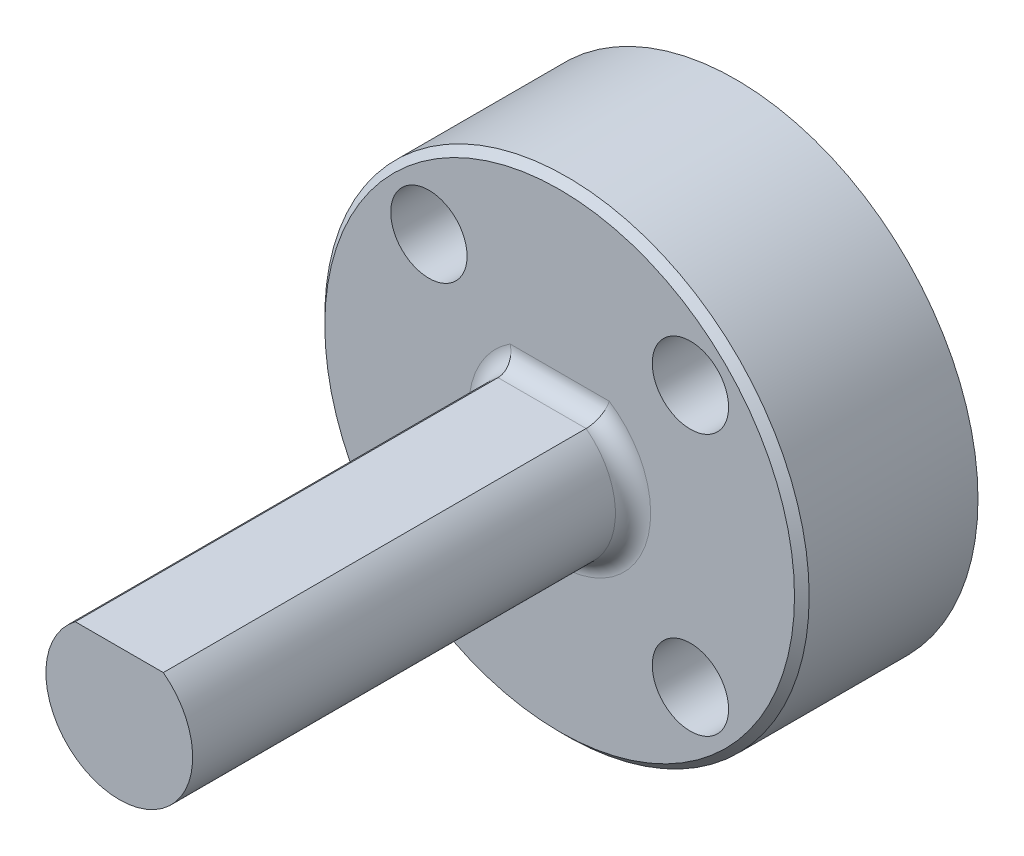
ISO-10303-21;
HEADER;
FILE_DESCRIPTION(('STEP AP214'),'2;1');
FILE_NAME('part.step','',(''),(''),'','','');
FILE_SCHEMA(('AUTOMOTIVE_DESIGN { 1 0 10303 214 1 1 1 1 }'));
ENDSEC;
DATA;
#1=APPLICATION_CONTEXT('core data for automotive mechanical design processes');
#2=APPLICATION_PROTOCOL_DEFINITION('international standard','automotive_design',2000,#1);
#3=PRODUCT_CONTEXT('',#1,'mechanical');
#4=PRODUCT('Part','Part','',(#3));
#5=PRODUCT_RELATED_PRODUCT_CATEGORY('part','',(#4));
#6=PRODUCT_DEFINITION_FORMATION('','',#4);
#7=PRODUCT_DEFINITION_CONTEXT('part definition',#1,'design');
#8=PRODUCT_DEFINITION('design','',#6,#7);
#9=PRODUCT_DEFINITION_SHAPE('','',#8);
#10=(LENGTH_UNIT() NAMED_UNIT(*) SI_UNIT(.MILLI.,.METRE.));
#11=(NAMED_UNIT(*) PLANE_ANGLE_UNIT() SI_UNIT($,.RADIAN.));
#12=(NAMED_UNIT(*) SI_UNIT($,.STERADIAN.) SOLID_ANGLE_UNIT());
#13=UNCERTAINTY_MEASURE_WITH_UNIT(LENGTH_MEASURE(1.E-05),#10,'distance_accuracy_value','');
#14=(GEOMETRIC_REPRESENTATION_CONTEXT(3) GLOBAL_UNCERTAINTY_ASSIGNED_CONTEXT((#13)) GLOBAL_UNIT_ASSIGNED_CONTEXT((#10,
#11,#12)) REPRESENTATION_CONTEXT('',''));
#15=CARTESIAN_POINT('',(0.,0.,0.));
#16=DIRECTION('',(0.,0.,1.));
#17=DIRECTION('',(1.,0.,0.));
#18=AXIS2_PLACEMENT_3D('',#15,#16,#17);
#19=CARTESIAN_POINT('',(5.65685424949245,17.6568542494923,26.67));
#20=DIRECTION('',(0.,0.,-1.));
#21=DIRECTION('',(-1.,0.,0.));
#22=AXIS2_PLACEMENT_3D('',#19,#20,#21);
#23=CYLINDRICAL_SURFACE('',#22,1.27);
#24=CARTESIAN_POINT('',(5.65685424949245,17.6568542494923,0.));
#25=DIRECTION('',(0.,0.,1.));
#26=DIRECTION('',(1.,0.,0.));
#27=AXIS2_PLACEMENT_3D('',#24,#25,#26);
#28=CIRCLE('',#27,1.27);
#29=CARTESIAN_POINT('',(6.92685424949245,17.6568542494923,0.));
#30=VERTEX_POINT('',#29);
#31=EDGE_CURVE('E133',#30,#30,#28,.T.);
#32=ORIENTED_EDGE('',*,*,#31,.F.);
#33=EDGE_LOOP('',(#32));
#34=FACE_BOUND('',#33,.T.);
#35=CARTESIAN_POINT('',(5.65685424949245,17.6568542494923,3.302));
#36=DIRECTION('',(0.,0.,1.));
#37=DIRECTION('',(1.,0.,0.));
#38=AXIS2_PLACEMENT_3D('',#35,#36,#37);
#39=CIRCLE('',#38,1.27);
#40=CARTESIAN_POINT('',(6.92685424949245,17.6568542494923,3.302));
#41=VERTEX_POINT('',#40);
#42=EDGE_CURVE('E138',#41,#41,#39,.F.);
#43=ORIENTED_EDGE('',*,*,#42,.F.);
#44=EDGE_LOOP('',(#43));
#45=FACE_BOUND('',#44,.T.);
#46=ADVANCED_FACE('F45',(#34,#45),#23,.F.);
#47=CARTESIAN_POINT('',(-5.65685424949229,17.6568542494923,26.67));
#48=DIRECTION('',(0.,0.,-1.));
#49=DIRECTION('',(-1.,0.,0.));
#50=AXIS2_PLACEMENT_3D('',#47,#48,#49);
#51=CYLINDRICAL_SURFACE('',#50,1.27);
#52=CARTESIAN_POINT('',(-5.65685424949229,17.6568542494923,0.));
#53=DIRECTION('',(0.,0.,1.));
#54=DIRECTION('',(1.,0.,0.));
#55=AXIS2_PLACEMENT_3D('',#52,#53,#54);
#56=CIRCLE('',#55,1.27);
#57=CARTESIAN_POINT('',(-4.38685424949229,17.6568542494923,0.));
#58=VERTEX_POINT('',#57);
#59=EDGE_CURVE('E137',#58,#58,#56,.T.);
#60=ORIENTED_EDGE('',*,*,#59,.F.);
#61=EDGE_LOOP('',(#60));
#62=FACE_BOUND('',#61,.T.);
#63=CARTESIAN_POINT('',(-5.65685424949229,17.6568542494923,3.302));
#64=DIRECTION('',(0.,0.,1.));
#65=DIRECTION('',(1.,0.,0.));
#66=AXIS2_PLACEMENT_3D('',#63,#64,#65);
#67=CIRCLE('',#66,1.27);
#68=CARTESIAN_POINT('',(-4.38685424949229,17.6568542494923,3.302));
#69=VERTEX_POINT('',#68);
#70=EDGE_CURVE('E158',#69,#69,#67,.F.);
#71=ORIENTED_EDGE('',*,*,#70,.F.);
#72=EDGE_LOOP('',(#71));
#73=FACE_BOUND('',#72,.T.);
#74=ADVANCED_FACE('F235',(#62,#73),#51,.F.);
#75=CARTESIAN_POINT('',(-5.65685424949247,6.34314575050743,26.67));
#76=DIRECTION('',(0.,0.,-1.));
#77=DIRECTION('',(-1.,0.,0.));
#78=AXIS2_PLACEMENT_3D('',#75,#76,#77);
#79=CYLINDRICAL_SURFACE('',#78,1.27);
#80=CARTESIAN_POINT('',(-5.65685424949247,6.34314575050743,0.));
#81=DIRECTION('',(0.,0.,1.));
#82=DIRECTION('',(1.,0.,0.));
#83=AXIS2_PLACEMENT_3D('',#80,#81,#82);
#84=CIRCLE('',#83,1.27);
#85=CARTESIAN_POINT('',(-4.38685424949247,6.34314575050743,0.));
#86=VERTEX_POINT('',#85);
#87=EDGE_CURVE('E142',#86,#86,#84,.T.);
#88=ORIENTED_EDGE('',*,*,#87,.F.);
#89=EDGE_LOOP('',(#88));
#90=FACE_BOUND('',#89,.T.);
#91=CARTESIAN_POINT('',(-5.65685424949247,6.34314575050743,3.302));
#92=DIRECTION('',(0.,0.,1.));
#93=DIRECTION('',(1.,0.,0.));
#94=AXIS2_PLACEMENT_3D('',#91,#92,#93);
#95=CIRCLE('',#94,1.27);
#96=CARTESIAN_POINT('',(-4.38685424949247,6.34314575050743,3.302));
#97=VERTEX_POINT('',#96);
#98=EDGE_CURVE('E153',#97,#97,#95,.F.);
#99=ORIENTED_EDGE('',*,*,#98,.F.);
#100=EDGE_LOOP('',(#99));
#101=FACE_BOUND('',#100,.T.);
#102=ADVANCED_FACE('F239',(#90,#101),#79,.F.);
#103=CARTESIAN_POINT('',(5.65685424949246,6.34314575050743,26.67));
#104=DIRECTION('',(0.,0.,-1.));
#105=DIRECTION('',(-1.,0.,0.));
#106=AXIS2_PLACEMENT_3D('',#103,#104,#105);
#107=CYLINDRICAL_SURFACE('',#106,1.27);
#108=CARTESIAN_POINT('',(5.65685424949246,6.34314575050743,0.));
#109=DIRECTION('',(0.,0.,1.));
#110=DIRECTION('',(1.,0.,0.));
#111=AXIS2_PLACEMENT_3D('',#108,#109,#110);
#112=CIRCLE('',#111,1.27);
#113=CARTESIAN_POINT('',(6.92685424949246,6.34314575050743,0.));
#114=VERTEX_POINT('',#113);
#115=EDGE_CURVE('E103',#114,#114,#112,.T.);
#116=ORIENTED_EDGE('',*,*,#115,.F.);
#117=EDGE_LOOP('',(#116));
#118=FACE_BOUND('',#117,.T.);
#119=CARTESIAN_POINT('',(5.65685424949246,6.34314575050743,3.302));
#120=DIRECTION('',(0.,0.,1.));
#121=DIRECTION('',(1.,0.,0.));
#122=AXIS2_PLACEMENT_3D('',#119,#120,#121);
#123=CIRCLE('',#122,1.27);
#124=CARTESIAN_POINT('',(6.92685424949246,6.34314575050743,3.302));
#125=VERTEX_POINT('',#124);
#126=EDGE_CURVE('E149',#125,#125,#123,.F.);
#127=ORIENTED_EDGE('',*,*,#126,.F.);
#128=EDGE_LOOP('',(#127));
#129=FACE_BOUND('',#128,.T.);
#130=ADVANCED_FACE('F202',(#118,#129),#107,.F.);
#131=CARTESIAN_POINT('',(0.,12.,7.62));
#132=DIRECTION('',(0.,0.,-1.));
#133=DIRECTION('',(-1.,0.,0.));
#134=AXIS2_PLACEMENT_3D('',#131,#132,#133);
#135=CYLINDRICAL_SURFACE('',#134,10.4775);
#136=CARTESIAN_POINT('',(0.,12.,7.30250000000002));
#137=DIRECTION('',(0.,0.,1.));
#138=DIRECTION('',(1.,0.,0.));
#139=AXIS2_PLACEMENT_3D('',#136,#137,#138);
#140=CIRCLE('',#139,10.4775);
#141=CARTESIAN_POINT('',(10.4775,12.,7.30250000000002));
#142=VERTEX_POINT('',#141);
#143=EDGE_CURVE('E168',#142,#142,#140,.F.);
#144=ORIENTED_EDGE('',*,*,#143,.T.);
#145=EDGE_LOOP('',(#144));
#146=FACE_BOUND('',#145,.T.);
#147=CARTESIAN_POINT('',(0.,12.,0.));
#148=DIRECTION('',(0.,0.,1.));
#149=DIRECTION('',(1.,0.,0.));
#150=AXIS2_PLACEMENT_3D('',#147,#148,#149);
#151=CIRCLE('',#150,10.4775);
#152=CARTESIAN_POINT('',(10.4775,12.,0.));
#153=VERTEX_POINT('',#152);
#154=EDGE_CURVE('E125',#153,#153,#151,.T.);
#155=ORIENTED_EDGE('',*,*,#154,.T.);
#156=EDGE_LOOP('',(#155));
#157=FACE_BOUND('',#156,.T.);
#158=ADVANCED_FACE('F198',(#146,#157),#135,.T.);
#159=CARTESIAN_POINT('',(0.,12.,7.62));
#160=DIRECTION('',(0.,0.,1.));
#161=DIRECTION('',(1.,0.,0.));
#162=AXIS2_PLACEMENT_3D('',#159,#160,#161);
#163=PLANE('',#162);
#164=CARTESIAN_POINT('',(0.,12.,7.62));
#165=DIRECTION('',(0.,0.,1.));
#166=DIRECTION('',(1.,0.,0.));
#167=AXIS2_PLACEMENT_3D('',#164,#165,#166);
#168=CIRCLE('',#167,3.937);
#169=CARTESIAN_POINT('',(2.14400676304903,15.302,7.62));
#170=VERTEX_POINT('',#169);
#171=CARTESIAN_POINT('',(-2.14400676304903,15.302,7.62));
#172=VERTEX_POINT('',#171);
#173=EDGE_CURVE('E67',#170,#172,#168,.F.);
#174=ORIENTED_EDGE('',*,*,#173,.T.);
#175=DIRECTION('',(-1.,0.,0.));
#176=VECTOR('',#175,1.);
#177=CARTESIAN_POINT('',(0.,15.302,7.62));
#178=LINE('',#177,#176);
#179=EDGE_CURVE('E60',#172,#170,#178,.F.);
#180=ORIENTED_EDGE('',*,*,#179,.T.);
#181=EDGE_LOOP('',(#174,#180));
#182=FACE_BOUND('',#181,.T.);
#183=CARTESIAN_POINT('',(0.,12.,7.62));
#184=DIRECTION('',(0.,0.,1.));
#185=DIRECTION('',(1.,0.,0.));
#186=AXIS2_PLACEMENT_3D('',#183,#184,#185);
#187=CIRCLE('',#186,10.16);
#188=CARTESIAN_POINT('',(10.16,12.,7.62));
#189=VERTEX_POINT('',#188);
#190=EDGE_CURVE('E132',#189,#189,#187,.T.);
#191=ORIENTED_EDGE('',*,*,#190,.T.);
#192=EDGE_LOOP('',(#191));
#193=FACE_BOUND('',#192,.T.);
#194=CARTESIAN_POINT('',(-5.65685424949247,6.34314575050743,7.62));
#195=DIRECTION('',(0.,0.,1.));
#196=DIRECTION('',(1.,0.,0.));
#197=AXIS2_PLACEMENT_3D('',#194,#195,#196);
#198=CIRCLE('',#197,1.651);
#199=CARTESIAN_POINT('',(-4.00585424949247,6.34314575050743,7.62));
#200=VERTEX_POINT('',#199);
#201=EDGE_CURVE('E303',#200,#200,#198,.T.);
#202=ORIENTED_EDGE('',*,*,#201,.F.);
#203=EDGE_LOOP('',(#202));
#204=FACE_BOUND('',#203,.T.);
#205=CARTESIAN_POINT('',(5.65685424949246,6.34314575050743,7.62));
#206=DIRECTION('',(0.,0.,1.));
#207=DIRECTION('',(1.,0.,0.));
#208=AXIS2_PLACEMENT_3D('',#205,#206,#207);
#209=CIRCLE('',#208,1.651);
#210=CARTESIAN_POINT('',(7.30785424949246,6.34314575050743,7.62));
#211=VERTEX_POINT('',#210);
#212=EDGE_CURVE('E293',#211,#211,#209,.T.);
#213=ORIENTED_EDGE('',*,*,#212,.F.);
#214=EDGE_LOOP('',(#213));
#215=FACE_BOUND('',#214,.T.);
#216=CARTESIAN_POINT('',(5.65685424949245,17.6568542494923,7.62));
#217=DIRECTION('',(0.,0.,1.));
#218=DIRECTION('',(1.,0.,0.));
#219=AXIS2_PLACEMENT_3D('',#216,#217,#218);
#220=CIRCLE('',#219,1.651);
#221=CARTESIAN_POINT('',(7.30785424949245,17.6568542494923,7.62));
#222=VERTEX_POINT('',#221);
#223=EDGE_CURVE('E284',#222,#222,#220,.T.);
#224=ORIENTED_EDGE('',*,*,#223,.F.);
#225=EDGE_LOOP('',(#224));
#226=FACE_BOUND('',#225,.T.);
#227=CARTESIAN_POINT('',(-5.65685424949229,17.6568542494923,7.62));
#228=DIRECTION('',(0.,0.,1.));
#229=DIRECTION('',(1.,0.,0.));
#230=AXIS2_PLACEMENT_3D('',#227,#228,#229);
#231=CIRCLE('',#230,1.651);
#232=CARTESIAN_POINT('',(-4.00585424949229,17.6568542494923,7.62));
#233=VERTEX_POINT('',#232);
#234=EDGE_CURVE('E287',#233,#233,#231,.T.);
#235=ORIENTED_EDGE('',*,*,#234,.F.);
#236=EDGE_LOOP('',(#235));
#237=FACE_BOUND('',#236,.T.);
#238=ADVANCED_FACE('F201',(#182,#193,#204,#215,#226,#237),#163,.T.);
#239=CARTESIAN_POINT('',(0.,12.,0.));
#240=DIRECTION('',(0.,0.,1.));
#241=DIRECTION('',(1.,0.,0.));
#242=AXIS2_PLACEMENT_3D('',#239,#240,#241);
#243=PLANE('',#242);
#244=ORIENTED_EDGE('',*,*,#115,.T.);
#245=EDGE_LOOP('',(#244));
#246=FACE_BOUND('',#245,.T.);
#247=ORIENTED_EDGE('',*,*,#87,.T.);
#248=EDGE_LOOP('',(#247));
#249=FACE_BOUND('',#248,.T.);
#250=ORIENTED_EDGE('',*,*,#59,.T.);
#251=EDGE_LOOP('',(#250));
#252=FACE_BOUND('',#251,.T.);
#253=ORIENTED_EDGE('',*,*,#31,.T.);
#254=EDGE_LOOP('',(#253));
#255=FACE_BOUND('',#254,.T.);
#256=CARTESIAN_POINT('',(0.,12.,0.));
#257=DIRECTION('',(0.,0.,-1.));
#258=DIRECTION('',(-1.,0.,0.));
#259=AXIS2_PLACEMENT_3D('',#256,#257,#258);
#260=CIRCLE('',#259,4.1275);
#261=CARTESIAN_POINT('',(-4.1275,12.,0.));
#262=VERTEX_POINT('',#261);
#263=EDGE_CURVE('E119',#262,#262,#260,.T.);
#264=ORIENTED_EDGE('',*,*,#263,.F.);
#265=EDGE_LOOP('',(#264));
#266=FACE_BOUND('',#265,.T.);
#267=ORIENTED_EDGE('',*,*,#154,.F.);
#268=EDGE_LOOP('',(#267));
#269=FACE_BOUND('',#268,.T.);
#270=ADVANCED_FACE('F204',(#246,#249,#252,#255,#266,#269),#243,.F.);
#271=CARTESIAN_POINT('',(0.,12.,2.286));
#272=DIRECTION('',(0.,0.,-1.));
#273=DIRECTION('',(-1.,0.,0.));
#274=AXIS2_PLACEMENT_3D('',#271,#272,#273);
#275=CYLINDRICAL_SURFACE('',#274,4.1275);
#276=CARTESIAN_POINT('',(0.,12.,2.286));
#277=DIRECTION('',(0.,0.,-1.));
#278=DIRECTION('',(-1.,0.,0.));
#279=AXIS2_PLACEMENT_3D('',#276,#277,#278);
#280=CIRCLE('',#279,4.1275);
#281=CARTESIAN_POINT('',(-4.1275,12.,2.286));
#282=VERTEX_POINT('',#281);
#283=EDGE_CURVE('E121',#282,#282,#280,.T.);
#284=ORIENTED_EDGE('',*,*,#283,.F.);
#285=EDGE_LOOP('',(#284));
#286=FACE_BOUND('',#285,.T.);
#287=ORIENTED_EDGE('',*,*,#263,.T.);
#288=EDGE_LOOP('',(#287));
#289=FACE_BOUND('',#288,.T.);
#290=ADVANCED_FACE('F207',(#286,#289),#275,.F.);
#291=CARTESIAN_POINT('',(0.,12.,2.286));
#292=DIRECTION('',(0.,0.,-1.));
#293=DIRECTION('',(-1.,0.,0.));
#294=AXIS2_PLACEMENT_3D('',#291,#292,#293);
#295=PLANE('',#294);
#296=CARTESIAN_POINT('',(0.,12.,2.286));
#297=DIRECTION('',(0.,0.,-1.));
#298=DIRECTION('',(-1.,0.,0.));
#299=AXIS2_PLACEMENT_3D('',#296,#297,#298);
#300=CIRCLE('',#299,2.413);
#301=CARTESIAN_POINT('',(-2.413,12.,2.286));
#302=VERTEX_POINT('',#301);
#303=EDGE_CURVE('E108',#302,#302,#300,.T.);
#304=ORIENTED_EDGE('',*,*,#303,.F.);
#305=EDGE_LOOP('',(#304));
#306=FACE_BOUND('',#305,.T.);
#307=ORIENTED_EDGE('',*,*,#283,.T.);
#308=EDGE_LOOP('',(#307));
#309=FACE_BOUND('',#308,.T.);
#310=ADVANCED_FACE('F213',(#306,#309),#295,.T.);
#311=CARTESIAN_POINT('',(0.,12.,4.572));
#312=DIRECTION('',(0.,0.,-1.));
#313=DIRECTION('',(-1.,0.,0.));
#314=AXIS2_PLACEMENT_3D('',#311,#312,#313);
#315=CYLINDRICAL_SURFACE('',#314,2.413);
#316=CARTESIAN_POINT('',(0.,12.,4.572));
#317=DIRECTION('',(0.,0.,-1.));
#318=DIRECTION('',(-1.,0.,0.));
#319=AXIS2_PLACEMENT_3D('',#316,#317,#318);
#320=CIRCLE('',#319,2.413);
#321=CARTESIAN_POINT('',(-2.413,12.,4.572));
#322=VERTEX_POINT('',#321);
#323=EDGE_CURVE('E113',#322,#322,#320,.T.);
#324=ORIENTED_EDGE('',*,*,#323,.F.);
#325=EDGE_LOOP('',(#324));
#326=FACE_BOUND('',#325,.T.);
#327=ORIENTED_EDGE('',*,*,#303,.T.);
#328=EDGE_LOOP('',(#327));
#329=FACE_BOUND('',#328,.T.);
#330=ADVANCED_FACE('F217',(#326,#329),#315,.F.);
#331=CARTESIAN_POINT('',(0.,12.,4.572));
#332=DIRECTION('',(0.,0.,-1.));
#333=DIRECTION('',(-1.,0.,0.));
#334=AXIS2_PLACEMENT_3D('',#331,#332,#333);
#335=PLANE('',#334);
#336=ORIENTED_EDGE('',*,*,#323,.T.);
#337=EDGE_LOOP('',(#336));
#338=FACE_BOUND('',#337,.T.);
#339=ADVANCED_FACE('F221',(#338),#335,.T.);
#340=CARTESIAN_POINT('',(0.,12.,26.67));
#341=DIRECTION('',(0.,0.,-1.));
#342=DIRECTION('',(-1.,0.,0.));
#343=AXIS2_PLACEMENT_3D('',#340,#341,#342);
#344=CYLINDRICAL_SURFACE('',#343,3.175);
#345=DIRECTION('',(0.,0.,-1.));
#346=VECTOR('',#345,1.);
#347=CARTESIAN_POINT('',(-1.905,14.54,26.67));
#348=LINE('',#347,#346);
#349=CARTESIAN_POINT('',(-1.905,14.54,26.67));
#350=VERTEX_POINT('',#349);
#351=CARTESIAN_POINT('',(-1.905,14.54,8.38200000000001));
#352=VERTEX_POINT('',#351);
#353=EDGE_CURVE('E94',#350,#352,#348,.T.);
#354=ORIENTED_EDGE('',*,*,#353,.T.);
#355=CARTESIAN_POINT('',(0.,12.,8.382));
#356=DIRECTION('',(0.,0.,1.));
#357=DIRECTION('',(1.,0.,0.));
#358=AXIS2_PLACEMENT_3D('',#355,#356,#357);
#359=CIRCLE('',#358,3.175);
#360=CARTESIAN_POINT('',(1.905,14.54,8.38200000000001));
#361=VERTEX_POINT('',#360);
#362=EDGE_CURVE('E11',#352,#361,#359,.T.);
#363=ORIENTED_EDGE('',*,*,#362,.T.);
#364=DIRECTION('',(0.,0.,-1.));
#365=VECTOR('',#364,1.);
#366=CARTESIAN_POINT('',(1.905,14.54,26.67));
#367=LINE('',#366,#365);
#368=CARTESIAN_POINT('',(1.905,14.54,26.67));
#369=VERTEX_POINT('',#368);
#370=EDGE_CURVE('E92',#369,#361,#367,.T.);
#371=ORIENTED_EDGE('',*,*,#370,.F.);
#372=CARTESIAN_POINT('',(0.,12.,26.67));
#373=DIRECTION('',(0.,0.,1.));
#374=DIRECTION('',(1.,0.,0.));
#375=AXIS2_PLACEMENT_3D('',#372,#373,#374);
#376=CIRCLE('',#375,3.175);
#377=EDGE_CURVE('E98',#350,#369,#376,.T.);
#378=ORIENTED_EDGE('',*,*,#377,.F.);
#379=EDGE_LOOP('',(#354,#363,#371,#378));
#380=FACE_BOUND('',#379,.T.);
#381=ADVANCED_FACE('F105',(#380),#344,.T.);
#382=CARTESIAN_POINT('',(-1.905,14.54,26.67));
#383=DIRECTION('',(0.,-1.,0.));
#384=DIRECTION('',(0.,0.,-1.));
#385=AXIS2_PLACEMENT_3D('',#382,#383,#384);
#386=PLANE('',#385);
#387=ORIENTED_EDGE('',*,*,#370,.T.);
#388=DIRECTION('',(-1.,0.,0.));
#389=VECTOR('',#388,1.);
#390=CARTESIAN_POINT('',(-1.905,14.54,8.382));
#391=LINE('',#390,#389);
#392=EDGE_CURVE('E172',#361,#352,#391,.T.);
#393=ORIENTED_EDGE('',*,*,#392,.T.);
#394=ORIENTED_EDGE('',*,*,#353,.F.);
#395=DIRECTION('',(-1.,0.,0.));
#396=VECTOR('',#395,1.);
#397=CARTESIAN_POINT('',(-1.905,14.54,26.67));
#398=LINE('',#397,#396);
#399=EDGE_CURVE('E87',#369,#350,#398,.T.);
#400=ORIENTED_EDGE('',*,*,#399,.F.);
#401=EDGE_LOOP('',(#387,#393,#394,#400));
#402=FACE_BOUND('',#401,.T.);
#403=ADVANCED_FACE('F89',(#402),#386,.F.);
#404=CARTESIAN_POINT('',(0.,12.,26.67));
#405=DIRECTION('',(0.,0.,1.));
#406=DIRECTION('',(1.,0.,0.));
#407=AXIS2_PLACEMENT_3D('',#404,#405,#406);
#408=PLANE('',#407);
#409=ORIENTED_EDGE('',*,*,#377,.T.);
#410=ORIENTED_EDGE('',*,*,#399,.T.);
#411=EDGE_LOOP('',(#409,#410));
#412=FACE_BOUND('',#411,.T.);
#413=ADVANCED_FACE('F100',(#412),#408,.T.);
#414=CARTESIAN_POINT('',(5.65685424949246,6.34314575050743,3.302));
#415=DIRECTION('',(0.,0.,1.));
#416=DIRECTION('',(1.,0.,0.));
#417=AXIS2_PLACEMENT_3D('',#414,#415,#416);
#418=PLANE('',#417);
#419=CARTESIAN_POINT('',(5.65685424949246,6.34314575050743,3.302));
#420=DIRECTION('',(0.,0.,1.));
#421=DIRECTION('',(1.,0.,0.));
#422=AXIS2_PLACEMENT_3D('',#419,#420,#421);
#423=CIRCLE('',#422,1.651);
#424=CARTESIAN_POINT('',(7.30785424949246,6.34314575050743,3.302));
#425=VERTEX_POINT('',#424);
#426=EDGE_CURVE('E299',#425,#425,#423,.T.);
#427=ORIENTED_EDGE('',*,*,#426,.T.);
#428=EDGE_LOOP('',(#427));
#429=FACE_BOUND('',#428,.T.);
#430=ORIENTED_EDGE('',*,*,#126,.T.);
#431=EDGE_LOOP('',(#430));
#432=FACE_BOUND('',#431,.T.);
#433=ADVANCED_FACE('F232',(#429,#432),#418,.T.);
#434=CARTESIAN_POINT('',(5.65685424949246,6.34314575050743,3.302));
#435=DIRECTION('',(0.,0.,1.));
#436=DIRECTION('',(1.,0.,0.));
#437=AXIS2_PLACEMENT_3D('',#434,#435,#436);
#438=CYLINDRICAL_SURFACE('',#437,1.651);
#439=ORIENTED_EDGE('',*,*,#426,.F.);
#440=EDGE_LOOP('',(#439));
#441=FACE_BOUND('',#440,.T.);
#442=ORIENTED_EDGE('',*,*,#212,.T.);
#443=EDGE_LOOP('',(#442));
#444=FACE_BOUND('',#443,.T.);
#445=ADVANCED_FACE('F260',(#441,#444),#438,.F.);
#446=CARTESIAN_POINT('',(-5.65685424949247,6.34314575050743,3.302));
#447=DIRECTION('',(0.,0.,1.));
#448=DIRECTION('',(1.,0.,0.));
#449=AXIS2_PLACEMENT_3D('',#446,#447,#448);
#450=PLANE('',#449);
#451=CARTESIAN_POINT('',(-5.65685424949247,6.34314575050743,3.302));
#452=DIRECTION('',(0.,0.,1.));
#453=DIRECTION('',(1.,0.,0.));
#454=AXIS2_PLACEMENT_3D('',#451,#452,#453);
#455=CIRCLE('',#454,1.651);
#456=CARTESIAN_POINT('',(-4.00585424949247,6.34314575050743,3.302));
#457=VERTEX_POINT('',#456);
#458=EDGE_CURVE('E307',#457,#457,#455,.T.);
#459=ORIENTED_EDGE('',*,*,#458,.T.);
#460=EDGE_LOOP('',(#459));
#461=FACE_BOUND('',#460,.T.);
#462=ORIENTED_EDGE('',*,*,#98,.T.);
#463=EDGE_LOOP('',(#462));
#464=FACE_BOUND('',#463,.T.);
#465=ADVANCED_FACE('F257',(#461,#464),#450,.T.);
#466=CARTESIAN_POINT('',(-5.65685424949247,6.34314575050743,3.302));
#467=DIRECTION('',(0.,0.,1.));
#468=DIRECTION('',(1.,0.,0.));
#469=AXIS2_PLACEMENT_3D('',#466,#467,#468);
#470=CYLINDRICAL_SURFACE('',#469,1.651);
#471=ORIENTED_EDGE('',*,*,#458,.F.);
#472=EDGE_LOOP('',(#471));
#473=FACE_BOUND('',#472,.T.);
#474=ORIENTED_EDGE('',*,*,#201,.T.);
#475=EDGE_LOOP('',(#474));
#476=FACE_BOUND('',#475,.T.);
#477=ADVANCED_FACE('F255',(#473,#476),#470,.F.);
#478=CARTESIAN_POINT('',(-5.65685424949229,17.6568542494923,3.302));
#479=DIRECTION('',(0.,0.,1.));
#480=DIRECTION('',(1.,0.,0.));
#481=AXIS2_PLACEMENT_3D('',#478,#479,#480);
#482=PLANE('',#481);
#483=CARTESIAN_POINT('',(-5.65685424949229,17.6568542494923,3.302));
#484=DIRECTION('',(0.,0.,1.));
#485=DIRECTION('',(1.,0.,0.));
#486=AXIS2_PLACEMENT_3D('',#483,#484,#485);
#487=CIRCLE('',#486,1.651);
#488=CARTESIAN_POINT('',(-4.00585424949229,17.6568542494923,3.302));
#489=VERTEX_POINT('',#488);
#490=EDGE_CURVE('E154',#489,#489,#487,.T.);
#491=ORIENTED_EDGE('',*,*,#490,.T.);
#492=EDGE_LOOP('',(#491));
#493=FACE_BOUND('',#492,.T.);
#494=ORIENTED_EDGE('',*,*,#70,.T.);
#495=EDGE_LOOP('',(#494));
#496=FACE_BOUND('',#495,.T.);
#497=ADVANCED_FACE('F251',(#493,#496),#482,.T.);
#498=CARTESIAN_POINT('',(-5.65685424949229,17.6568542494923,3.302));
#499=DIRECTION('',(0.,0.,1.));
#500=DIRECTION('',(1.,0.,0.));
#501=AXIS2_PLACEMENT_3D('',#498,#499,#500);
#502=CYLINDRICAL_SURFACE('',#501,1.651);
#503=ORIENTED_EDGE('',*,*,#490,.F.);
#504=EDGE_LOOP('',(#503));
#505=FACE_BOUND('',#504,.T.);
#506=ORIENTED_EDGE('',*,*,#234,.T.);
#507=EDGE_LOOP('',(#506));
#508=FACE_BOUND('',#507,.T.);
#509=ADVANCED_FACE('F247',(#505,#508),#502,.F.);
#510=CARTESIAN_POINT('',(5.65685424949245,17.6568542494923,3.302));
#511=DIRECTION('',(0.,0.,1.));
#512=DIRECTION('',(1.,0.,0.));
#513=AXIS2_PLACEMENT_3D('',#510,#511,#512);
#514=PLANE('',#513);
#515=CARTESIAN_POINT('',(5.65685424949245,17.6568542494923,3.302));
#516=DIRECTION('',(0.,0.,1.));
#517=DIRECTION('',(1.,0.,0.));
#518=AXIS2_PLACEMENT_3D('',#515,#516,#517);
#519=CIRCLE('',#518,1.651);
#520=CARTESIAN_POINT('',(7.30785424949245,17.6568542494923,3.302));
#521=VERTEX_POINT('',#520);
#522=EDGE_CURVE('E281',#521,#521,#519,.T.);
#523=ORIENTED_EDGE('',*,*,#522,.T.);
#524=EDGE_LOOP('',(#523));
#525=FACE_BOUND('',#524,.T.);
#526=ORIENTED_EDGE('',*,*,#42,.T.);
#527=EDGE_LOOP('',(#526));
#528=FACE_BOUND('',#527,.T.);
#529=ADVANCED_FACE('F250',(#525,#528),#514,.T.);
#530=CARTESIAN_POINT('',(5.65685424949245,17.6568542494923,3.302));
#531=DIRECTION('',(0.,0.,1.));
#532=DIRECTION('',(1.,0.,0.));
#533=AXIS2_PLACEMENT_3D('',#530,#531,#532);
#534=CYLINDRICAL_SURFACE('',#533,1.651);
#535=ORIENTED_EDGE('',*,*,#522,.F.);
#536=EDGE_LOOP('',(#535));
#537=FACE_BOUND('',#536,.T.);
#538=ORIENTED_EDGE('',*,*,#223,.T.);
#539=EDGE_LOOP('',(#538));
#540=FACE_BOUND('',#539,.T.);
#541=ADVANCED_FACE('F196',(#537,#540),#534,.F.);
#542=CARTESIAN_POINT('',(0.,12.,7.62));
#543=DIRECTION('',(0.,0.,-1.));
#544=DIRECTION('',(-1.,0.,0.));
#545=AXIS2_PLACEMENT_3D('',#542,#543,#544);
#546=CONICAL_SURFACE('',#545,10.16,0.785398163397446);
#547=ORIENTED_EDGE('',*,*,#143,.F.);
#548=EDGE_LOOP('',(#547));
#549=FACE_BOUND('',#548,.T.);
#550=ORIENTED_EDGE('',*,*,#190,.F.);
#551=EDGE_LOOP('',(#550));
#552=FACE_BOUND('',#551,.T.);
#553=ADVANCED_FACE('F188',(#549,#552),#546,.T.);
#554=CARTESIAN_POINT('',(0.,12.,8.382));
#555=DIRECTION('',(0.,0.,1.));
#556=DIRECTION('',(1.,0.,0.));
#557=AXIS2_PLACEMENT_3D('',#554,#555,#556);
#558=TOROIDAL_SURFACE('',#557,3.937,0.762);
#559=CARTESIAN_POINT('',(-1.905,14.54,8.38200000000001));
#560=CARTESIAN_POINT('',(-1.90498198882283,14.539957214244,8.34066054336164));
#561=CARTESIAN_POINT('',(-1.90612038231634,14.5433611627114,8.29934631398863));
#562=CARTESIAN_POINT('',(-1.91057091654426,14.5567303598732,8.21800539251342));
#563=CARTESIAN_POINT('',(-1.91387817494708,14.5666808717619,8.17797601986924));
#564=CARTESIAN_POINT('',(-1.92252815003399,14.592812628296,8.10024937110517));
#565=CARTESIAN_POINT('',(-1.92787069820224,14.6089933570994,8.062551902211));
#566=CARTESIAN_POINT('',(-1.94035546293283,14.6470198832379,7.9904574539362));
#567=CARTESIAN_POINT('',(-1.94749808310488,14.668866951104,7.9560612171449));
#568=CARTESIAN_POINT('',(-1.96348815192958,14.7181067932196,7.89064712164037));
#569=CARTESIAN_POINT('',(-1.97237128121235,14.7456163799728,7.85972605715368));
#570=CARTESIAN_POINT('',(-1.99140796044663,14.8050316029536,7.80289956114672));
#571=CARTESIAN_POINT('',(-2.00156195861614,14.8369387905584,7.77699590745053));
#572=CARTESIAN_POINT('',(-2.02331724513359,14.9058770995411,7.72964903557362));
#573=CARTESIAN_POINT('',(-2.0349644355059,14.9430799022702,7.70847707851295));
#574=CARTESIAN_POINT('',(-2.05892489865831,15.0203176883996,7.67269807593555));
#575=CARTESIAN_POINT('',(-2.07123808326745,15.0603522971119,7.65809016377683));
#576=CARTESIAN_POINT('',(-2.09332296545248,15.1328212878724,7.63829610707394));
#577=CARTESIAN_POINT('',(-2.10303332787208,15.1649049162093,7.63172054476719));
#578=CARTESIAN_POINT('',(-2.12247784965307,15.2296008751976,7.62274701532386));
#579=CARTESIAN_POINT('',(-2.13221192900531,15.2622120882751,7.62034115225621));
#580=CARTESIAN_POINT('',(-2.14259011219108,15.2972180128178,7.62001122693733));
#581=CARTESIAN_POINT('',(-2.14329862854997,15.2996090536686,7.61999997009276));
#582=CARTESIAN_POINT('',(-2.14400676304904,15.302,7.62));
#583=B_SPLINE_CURVE_WITH_KNOTS('',3,(#559,#560,#561,#562,#563,#564,#565,#566,#567,#568,#569,
#570,#571,#572,#573,#574,#575,#576,#577,#578,#579,#580,#581,#582),.UNSPECIFIED.,.F.,.F.,(4,2,2,
2,2,2,2,2,2,2,2,4),(0.,0.123824029712928,0.247370271593064,0.370906286440228,0.49447002504845,
0.620898018280435,0.747370727245086,0.879868154810117,1.01234808377499,1.1145922005191,
1.21664249076736,1.22412386775628),.UNSPECIFIED.);
#584=EDGE_CURVE('E178',#172,#352,#583,.F.);
#585=ORIENTED_EDGE('',*,*,#584,.F.);
#586=ORIENTED_EDGE('',*,*,#173,.F.);
#587=CARTESIAN_POINT('',(1.905,14.54,8.38200000000001));
#588=CARTESIAN_POINT('',(1.90498198882283,14.539957214244,8.34066054336164));
#589=CARTESIAN_POINT('',(1.90612038231634,14.5433611627114,8.29934631398863));
#590=CARTESIAN_POINT('',(1.91057091654426,14.5567303598732,8.21800539251342));
#591=CARTESIAN_POINT('',(1.91387817494708,14.5666808717619,8.17797601986924));
#592=CARTESIAN_POINT('',(1.92252815003399,14.592812628296,8.10024937110517));
#593=CARTESIAN_POINT('',(1.92787069820224,14.6089933570994,8.062551902211));
#594=CARTESIAN_POINT('',(1.94035546293283,14.6470198832379,7.9904574539362));
#595=CARTESIAN_POINT('',(1.94749808310488,14.668866951104,7.9560612171449));
#596=CARTESIAN_POINT('',(1.96348815192958,14.7181067932196,7.89064712164037));
#597=CARTESIAN_POINT('',(1.97237128121235,14.7456163799728,7.85972605715368));
#598=CARTESIAN_POINT('',(1.99140796044663,14.8050316029536,7.80289956114672));
#599=CARTESIAN_POINT('',(2.00156195861614,14.8369387905584,7.77699590745053));
#600=CARTESIAN_POINT('',(2.02331724513359,14.9058770995411,7.72964903557362));
#601=CARTESIAN_POINT('',(2.0349644355059,14.9430799022702,7.70847707851295));
#602=CARTESIAN_POINT('',(2.05892489865831,15.0203176883996,7.67269807593555));
#603=CARTESIAN_POINT('',(2.07123808326745,15.0603522971119,7.65809016377683));
#604=CARTESIAN_POINT('',(2.09332296545248,15.1328212878724,7.63829610707394));
#605=CARTESIAN_POINT('',(2.10303332787208,15.1649049162093,7.63172054476719));
#606=CARTESIAN_POINT('',(2.12247784965307,15.2296008751976,7.62274701532386));
#607=CARTESIAN_POINT('',(2.13221192900531,15.2622120882751,7.62034115225621));
#608=CARTESIAN_POINT('',(2.14259011219108,15.2972180128178,7.62001122693733));
#609=CARTESIAN_POINT('',(2.14329862854997,15.2996090536686,7.61999997009276));
#610=CARTESIAN_POINT('',(2.14400676304904,15.302,7.62));
#611=B_SPLINE_CURVE_WITH_KNOTS('',3,(#587,#588,#589,#590,#591,#592,#593,#594,#595,#596,#597,
#598,#599,#600,#601,#602,#603,#604,#605,#606,#607,#608,#609,#610),.UNSPECIFIED.,.F.,.F.,(4,2,2,
2,2,2,2,2,2,2,2,4),(0.,0.123824029712928,0.247370271593064,0.370906286440228,0.49447002504845,
0.620898018280435,0.747370727245086,0.879868154810117,1.01234808377499,1.1145922005191,
1.21664249076736,1.22412386775628),.UNSPECIFIED.);
#612=EDGE_CURVE('E50',#361,#170,#611,.T.);
#613=ORIENTED_EDGE('',*,*,#612,.F.);
#614=ORIENTED_EDGE('',*,*,#362,.F.);
#615=EDGE_LOOP('',(#585,#586,#613,#614));
#616=FACE_BOUND('',#615,.T.);
#617=ADVANCED_FACE('F184',(#616),#558,.F.);
#618=CARTESIAN_POINT('',(-1.905,15.302,8.382));
#619=DIRECTION('',(-1.,0.,0.));
#620=DIRECTION('',(0.,0.,1.));
#621=AXIS2_PLACEMENT_3D('',#618,#619,#620);
#622=CYLINDRICAL_SURFACE('',#621,0.762);
#623=ORIENTED_EDGE('',*,*,#612,.T.);
#624=ORIENTED_EDGE('',*,*,#179,.F.);
#625=ORIENTED_EDGE('',*,*,#584,.T.);
#626=ORIENTED_EDGE('',*,*,#392,.F.);
#627=EDGE_LOOP('',(#623,#624,#625,#626));
#628=FACE_BOUND('',#627,.T.);
#629=ADVANCED_FACE('F47',(#628),#622,.F.);
#630=CLOSED_SHELL('',(#46,#74,#102,#130,#158,#238,#270,#290,#310,#330,#339,#381,#403,#413,#433,
#445,#465,#477,#497,#509,#529,#541,#553,#617,#629));
#631=MANIFOLD_SOLID_BREP('B2',#630);
#632=ADVANCED_BREP_SHAPE_REPRESENTATION('',(#18,#631),#14);
#633=SHAPE_DEFINITION_REPRESENTATION(#9,#632);
ENDSEC;
END-ISO-10303-21;
